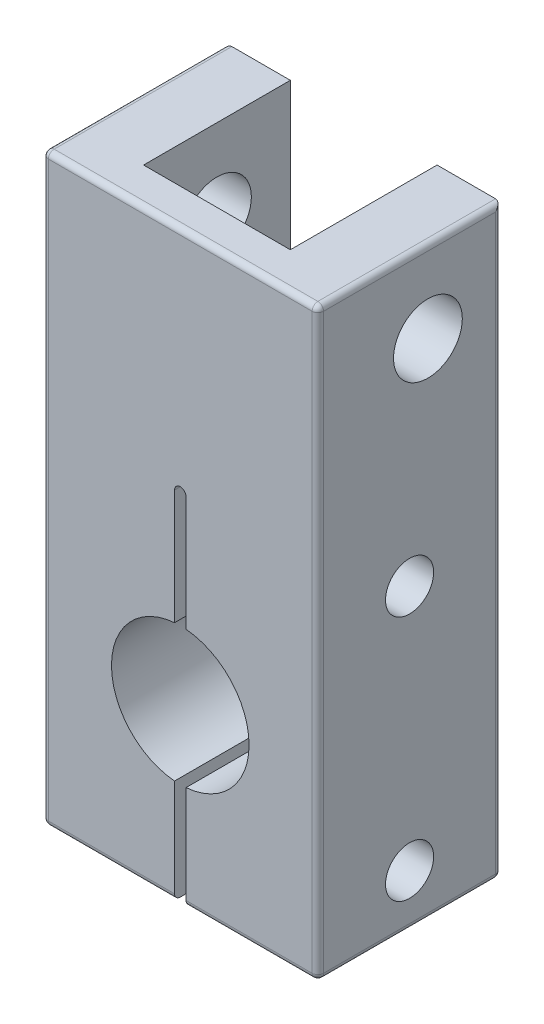
ISO-10303-21;
HEADER;
FILE_DESCRIPTION(('STEP AP214'),'2;1');
FILE_NAME('part.step','',(''),(''),'','','');
FILE_SCHEMA(('AUTOMOTIVE_DESIGN { 1 0 10303 214 1 1 1 1 }'));
ENDSEC;
DATA;
#1=APPLICATION_CONTEXT('core data for automotive mechanical design processes');
#2=APPLICATION_PROTOCOL_DEFINITION('international standard','automotive_design',2000,#1);
#3=PRODUCT_CONTEXT('',#1,'mechanical');
#4=PRODUCT('Part','Part','',(#3));
#5=PRODUCT_RELATED_PRODUCT_CATEGORY('part','',(#4));
#6=PRODUCT_DEFINITION_FORMATION('','',#4);
#7=PRODUCT_DEFINITION_CONTEXT('part definition',#1,'design');
#8=PRODUCT_DEFINITION('design','',#6,#7);
#9=PRODUCT_DEFINITION_SHAPE('','',#8);
#10=(LENGTH_UNIT() NAMED_UNIT(*) SI_UNIT(.MILLI.,.METRE.));
#11=(NAMED_UNIT(*) PLANE_ANGLE_UNIT() SI_UNIT($,.RADIAN.));
#12=(NAMED_UNIT(*) SI_UNIT($,.STERADIAN.) SOLID_ANGLE_UNIT());
#13=UNCERTAINTY_MEASURE_WITH_UNIT(LENGTH_MEASURE(1.E-05),#10,'distance_accuracy_value','');
#14=(GEOMETRIC_REPRESENTATION_CONTEXT(3) GLOBAL_UNCERTAINTY_ASSIGNED_CONTEXT((#13)) GLOBAL_UNIT_ASSIGNED_CONTEXT((#10,
#11,#12)) REPRESENTATION_CONTEXT('',''));
#15=CARTESIAN_POINT('',(0.,0.,0.));
#16=DIRECTION('',(0.,0.,1.));
#17=DIRECTION('',(1.,0.,0.));
#18=AXIS2_PLACEMENT_3D('',#15,#16,#17);
#19=CARTESIAN_POINT('',(0.,0.,16.));
#20=DIRECTION('',(0.,1.,0.));
#21=DIRECTION('',(0.,0.,1.));
#22=AXIS2_PLACEMENT_3D('',#19,#20,#21);
#23=PLANE('',#22);
#24=DIRECTION('',(0.,0.,-1.));
#25=VECTOR('',#24,1.);
#26=CARTESIAN_POINT('',(0.499999999999999,0.,16.));
#27=LINE('',#26,#25);
#28=CARTESIAN_POINT('',(0.499999999999999,0.,15.5));
#29=VERTEX_POINT('',#28);
#30=CARTESIAN_POINT('',(0.499999999999999,0.,0.5));
#31=VERTEX_POINT('',#30);
#32=EDGE_CURVE('E370',#29,#31,#27,.T.);
#33=ORIENTED_EDGE('',*,*,#32,.T.);
#34=DIRECTION('',(1.,0.,0.));
#35=VECTOR('',#34,1.);
#36=CARTESIAN_POINT('',(0.,0.,0.5));
#37=LINE('',#36,#35);
#38=CARTESIAN_POINT('',(11.5,0.,0.5));
#39=VERTEX_POINT('',#38);
#40=EDGE_CURVE('E372',#31,#39,#37,.T.);
#41=ORIENTED_EDGE('',*,*,#40,.T.);
#42=DIRECTION('',(0.,0.,-1.));
#43=VECTOR('',#42,1.);
#44=CARTESIAN_POINT('',(11.5,0.,16.001));
#45=LINE('',#44,#43);
#46=CARTESIAN_POINT('',(11.5,0.,15.5));
#47=VERTEX_POINT('',#46);
#48=EDGE_CURVE('E266',#47,#39,#45,.T.);
#49=ORIENTED_EDGE('',*,*,#48,.F.);
#50=DIRECTION('',(1.,0.,0.));
#51=VECTOR('',#50,1.);
#52=CARTESIAN_POINT('',(0.,0.,15.5));
#53=LINE('',#52,#51);
#54=EDGE_CURVE('E368',#47,#29,#53,.F.);
#55=ORIENTED_EDGE('',*,*,#54,.T.);
#56=EDGE_LOOP('',(#33,#41,#49,#55));
#57=FACE_BOUND('',#56,.T.);
#58=ADVANCED_FACE('F33',(#57),#23,.F.);
#59=CARTESIAN_POINT('',(12.,15.,16.));
#60=DIRECTION('',(0.,0.,-1.));
#61=DIRECTION('',(-1.,0.,0.));
#62=AXIS2_PLACEMENT_3D('',#59,#60,#61);
#63=CYLINDRICAL_SURFACE('',#62,6.);
#64=DIRECTION('',(0.,0.,-1.));
#65=VECTOR('',#64,1.);
#66=CARTESIAN_POINT('',(11.5,9.0208696284493,16.));
#67=LINE('',#66,#65);
#68=CARTESIAN_POINT('',(11.5,9.0208696284493,16.));
#69=VERTEX_POINT('',#68);
#70=CARTESIAN_POINT('',(11.5,9.0208696284493,0.));
#71=VERTEX_POINT('',#70);
#72=EDGE_CURVE('E274',#69,#71,#67,.T.);
#73=ORIENTED_EDGE('',*,*,#72,.T.);
#74=CARTESIAN_POINT('',(12.,15.,0.));
#75=DIRECTION('',(0.,0.,1.));
#76=DIRECTION('',(1.,0.,0.));
#77=AXIS2_PLACEMENT_3D('',#74,#75,#76);
#78=CIRCLE('',#77,6.);
#79=CARTESIAN_POINT('',(11.5,20.9791303715507,0.));
#80=VERTEX_POINT('',#79);
#81=EDGE_CURVE('E321',#80,#71,#78,.T.);
#82=ORIENTED_EDGE('',*,*,#81,.F.);
#83=DIRECTION('',(0.,0.,-1.));
#84=VECTOR('',#83,1.);
#85=CARTESIAN_POINT('',(11.5,20.9791303715507,16.));
#86=LINE('',#85,#84);
#87=CARTESIAN_POINT('',(11.5,20.9791303715507,16.));
#88=VERTEX_POINT('',#87);
#89=EDGE_CURVE('E290',#80,#88,#86,.F.);
#90=ORIENTED_EDGE('',*,*,#89,.T.);
#91=CARTESIAN_POINT('',(12.,15.,16.));
#92=DIRECTION('',(0.,0.,1.));
#93=DIRECTION('',(1.,0.,0.));
#94=AXIS2_PLACEMENT_3D('',#91,#92,#93);
#95=CIRCLE('',#94,6.);
#96=EDGE_CURVE('E316',#88,#69,#95,.T.);
#97=ORIENTED_EDGE('',*,*,#96,.T.);
#98=EDGE_LOOP('',(#73,#82,#90,#97));
#99=FACE_BOUND('',#98,.T.);
#100=ADVANCED_FACE('F484',(#99),#63,.F.);
#101=CARTESIAN_POINT('',(0.,0.,16.));
#102=DIRECTION('',(0.,0.,1.));
#103=DIRECTION('',(1.,0.,0.));
#104=AXIS2_PLACEMENT_3D('',#101,#102,#103);
#105=PLANE('',#104);
#106=DIRECTION('',(0.,-1.,0.));
#107=VECTOR('',#106,1.);
#108=CARTESIAN_POINT('',(0.499999999999999,0.,16.));
#109=LINE('',#108,#107);
#110=CARTESIAN_POINT('',(0.500000000000001,50.5,16.));
#111=VERTEX_POINT('',#110);
#112=CARTESIAN_POINT('',(0.499999999999999,0.5,16.));
#113=VERTEX_POINT('',#112);
#114=EDGE_CURVE('E382',#111,#113,#109,.T.);
#115=ORIENTED_EDGE('',*,*,#114,.T.);
#116=DIRECTION('',(1.,0.,0.));
#117=VECTOR('',#116,1.);
#118=CARTESIAN_POINT('',(11.5,0.5,16.));
#119=LINE('',#118,#117);
#120=CARTESIAN_POINT('',(11.5,0.5,16.));
#121=VERTEX_POINT('',#120);
#122=EDGE_CURVE('E386',#113,#121,#119,.T.);
#123=ORIENTED_EDGE('',*,*,#122,.T.);
#124=DIRECTION('',(0.,1.,0.));
#125=VECTOR('',#124,1.);
#126=CARTESIAN_POINT('',(11.5,31.,16.));
#127=LINE('',#126,#125);
#128=EDGE_CURVE('E265',#121,#69,#127,.T.);
#129=ORIENTED_EDGE('',*,*,#128,.T.);
#130=ORIENTED_EDGE('',*,*,#96,.F.);
#131=DIRECTION('',(0.,1.,0.));
#132=VECTOR('',#131,1.);
#133=CARTESIAN_POINT('',(11.5,31.,16.));
#134=LINE('',#133,#132);
#135=CARTESIAN_POINT('',(11.5,31.,16.));
#136=VERTEX_POINT('',#135);
#137=EDGE_CURVE('E296',#88,#136,#134,.T.);
#138=ORIENTED_EDGE('',*,*,#137,.T.);
#139=CARTESIAN_POINT('',(12.,31.,16.));
#140=DIRECTION('',(0.,0.,1.));
#141=DIRECTION('',(1.,0.,0.));
#142=AXIS2_PLACEMENT_3D('',#139,#140,#141);
#143=CIRCLE('',#142,0.500000000000002);
#144=CARTESIAN_POINT('',(12.5,31.,16.));
#145=VERTEX_POINT('',#144);
#146=EDGE_CURVE('E293',#136,#145,#143,.F.);
#147=ORIENTED_EDGE('',*,*,#146,.T.);
#148=DIRECTION('',(0.,-1.,0.));
#149=VECTOR('',#148,1.);
#150=CARTESIAN_POINT('',(12.5,31.,16.));
#151=LINE('',#150,#149);
#152=CARTESIAN_POINT('',(12.5,20.9791303715507,16.));
#153=VERTEX_POINT('',#152);
#154=EDGE_CURVE('E311',#145,#153,#151,.T.);
#155=ORIENTED_EDGE('',*,*,#154,.T.);
#156=CARTESIAN_POINT('',(12.5,9.0208696284493,16.));
#157=VERTEX_POINT('',#156);
#158=EDGE_CURVE('E320',#157,#153,#95,.T.);
#159=ORIENTED_EDGE('',*,*,#158,.F.);
#160=DIRECTION('',(0.,-1.,0.));
#161=VECTOR('',#160,1.);
#162=CARTESIAN_POINT('',(12.5,31.,16.));
#163=LINE('',#162,#161);
#164=CARTESIAN_POINT('',(12.5,0.5,16.));
#165=VERTEX_POINT('',#164);
#166=EDGE_CURVE('E280',#157,#165,#163,.T.);
#167=ORIENTED_EDGE('',*,*,#166,.T.);
#168=DIRECTION('',(1.,0.,0.));
#169=VECTOR('',#168,1.);
#170=CARTESIAN_POINT('',(24.,0.5,16.));
#171=LINE('',#170,#169);
#172=CARTESIAN_POINT('',(23.5,0.5,16.));
#173=VERTEX_POINT('',#172);
#174=EDGE_CURVE('E384',#165,#173,#171,.T.);
#175=ORIENTED_EDGE('',*,*,#174,.T.);
#176=DIRECTION('',(0.,1.,0.));
#177=VECTOR('',#176,1.);
#178=CARTESIAN_POINT('',(23.5,51.,16.));
#179=LINE('',#178,#177);
#180=CARTESIAN_POINT('',(23.5,50.5,16.));
#181=VERTEX_POINT('',#180);
#182=EDGE_CURVE('E380',#173,#181,#179,.T.);
#183=ORIENTED_EDGE('',*,*,#182,.T.);
#184=DIRECTION('',(-1.,0.,0.));
#185=VECTOR('',#184,1.);
#186=CARTESIAN_POINT('',(0.,50.5,16.));
#187=LINE('',#186,#185);
#188=EDGE_CURVE('E378',#181,#111,#187,.T.);
#189=ORIENTED_EDGE('',*,*,#188,.T.);
#190=EDGE_LOOP('',(#115,#123,#129,#130,#138,#147,#155,#159,#167,#175,#183,#189));
#191=FACE_BOUND('',#190,.T.);
#192=ADVANCED_FACE('F491',(#191),#105,.T.);
#193=CARTESIAN_POINT('',(0.,0.,0.));
#194=DIRECTION('',(0.,0.,1.));
#195=DIRECTION('',(1.,0.,0.));
#196=AXIS2_PLACEMENT_3D('',#193,#194,#195);
#197=PLANE('',#196);
#198=DIRECTION('',(1.,0.,0.));
#199=VECTOR('',#198,1.);
#200=CARTESIAN_POINT('',(0.,0.5,0.));
#201=LINE('',#200,#199);
#202=CARTESIAN_POINT('',(11.5,0.500000000000007,0.));
#203=VERTEX_POINT('',#202);
#204=CARTESIAN_POINT('',(0.499999999999999,0.5,0.));
#205=VERTEX_POINT('',#204);
#206=EDGE_CURVE('E354',#203,#205,#201,.F.);
#207=ORIENTED_EDGE('',*,*,#206,.T.);
#208=DIRECTION('',(0.,-1.,0.));
#209=VECTOR('',#208,1.);
#210=CARTESIAN_POINT('',(0.499999999999999,0.,0.));
#211=LINE('',#210,#209);
#212=CARTESIAN_POINT('',(0.5,51.,0.));
#213=VERTEX_POINT('',#212);
#214=EDGE_CURVE('E356',#205,#213,#211,.F.);
#215=ORIENTED_EDGE('',*,*,#214,.T.);
#216=DIRECTION('',(-1.,0.,0.));
#217=VECTOR('',#216,1.);
#218=CARTESIAN_POINT('',(24.,51.,0.));
#219=LINE('',#218,#217);
#220=CARTESIAN_POINT('',(5.59999999999999,51.,0.));
#221=VERTEX_POINT('',#220);
#222=EDGE_CURVE('E319',#221,#213,#219,.T.);
#223=ORIENTED_EDGE('',*,*,#222,.F.);
#224=DIRECTION('',(0.,1.,0.));
#225=VECTOR('',#224,1.);
#226=CARTESIAN_POINT('',(5.59999999999999,36.,0.));
#227=LINE('',#226,#225);
#228=CARTESIAN_POINT('',(5.59999999999999,36.,0.));
#229=VERTEX_POINT('',#228);
#230=EDGE_CURVE('E239',#229,#221,#227,.T.);
#231=ORIENTED_EDGE('',*,*,#230,.F.);
#232=DIRECTION('',(-1.,0.,0.));
#233=VECTOR('',#232,1.);
#234=CARTESIAN_POINT('',(5.59999999999999,36.,0.));
#235=LINE('',#234,#233);
#236=CARTESIAN_POINT('',(18.4,36.,0.));
#237=VERTEX_POINT('',#236);
#238=EDGE_CURVE('E213',#237,#229,#235,.T.);
#239=ORIENTED_EDGE('',*,*,#238,.F.);
#240=DIRECTION('',(0.,1.,0.));
#241=VECTOR('',#240,1.);
#242=CARTESIAN_POINT('',(18.4,36.,0.));
#243=LINE('',#242,#241);
#244=CARTESIAN_POINT('',(18.4,51.,0.));
#245=VERTEX_POINT('',#244);
#246=EDGE_CURVE('E242',#237,#245,#243,.T.);
#247=ORIENTED_EDGE('',*,*,#246,.T.);
#248=CARTESIAN_POINT('',(23.5,51.,0.));
#249=VERTEX_POINT('',#248);
#250=EDGE_CURVE('E324',#249,#245,#219,.T.);
#251=ORIENTED_EDGE('',*,*,#250,.F.);
#252=DIRECTION('',(0.,1.,0.));
#253=VECTOR('',#252,1.);
#254=CARTESIAN_POINT('',(23.5,0.,0.));
#255=LINE('',#254,#253);
#256=CARTESIAN_POINT('',(23.5,0.5,0.));
#257=VERTEX_POINT('',#256);
#258=EDGE_CURVE('E350',#249,#257,#255,.F.);
#259=ORIENTED_EDGE('',*,*,#258,.T.);
#260=DIRECTION('',(1.,0.,0.));
#261=VECTOR('',#260,1.);
#262=CARTESIAN_POINT('',(0.,0.5,0.));
#263=LINE('',#262,#261);
#264=CARTESIAN_POINT('',(12.5,0.500000000000007,0.));
#265=VERTEX_POINT('',#264);
#266=EDGE_CURVE('E352',#257,#265,#263,.F.);
#267=ORIENTED_EDGE('',*,*,#266,.T.);
#268=DIRECTION('',(0.,-1.,0.));
#269=VECTOR('',#268,1.);
#270=CARTESIAN_POINT('',(12.5,31.,0.));
#271=LINE('',#270,#269);
#272=CARTESIAN_POINT('',(12.5,9.0208696284493,0.));
#273=VERTEX_POINT('',#272);
#274=EDGE_CURVE('E270',#273,#265,#271,.T.);
#275=ORIENTED_EDGE('',*,*,#274,.F.);
#276=CARTESIAN_POINT('',(12.5,20.9791303715507,0.));
#277=VERTEX_POINT('',#276);
#278=EDGE_CURVE('E315',#273,#277,#78,.T.);
#279=ORIENTED_EDGE('',*,*,#278,.T.);
#280=DIRECTION('',(0.,-1.,0.));
#281=VECTOR('',#280,1.);
#282=CARTESIAN_POINT('',(12.5,31.,0.));
#283=LINE('',#282,#281);
#284=CARTESIAN_POINT('',(12.5,31.,0.));
#285=VERTEX_POINT('',#284);
#286=EDGE_CURVE('E302',#285,#277,#283,.T.);
#287=ORIENTED_EDGE('',*,*,#286,.F.);
#288=CARTESIAN_POINT('',(12.,31.,0.));
#289=DIRECTION('',(0.,0.,-1.));
#290=DIRECTION('',(-1.,0.,0.));
#291=AXIS2_PLACEMENT_3D('',#288,#289,#290);
#292=CIRCLE('',#291,0.500000000000002);
#293=CARTESIAN_POINT('',(11.5,31.,0.));
#294=VERTEX_POINT('',#293);
#295=EDGE_CURVE('E299',#294,#285,#292,.T.);
#296=ORIENTED_EDGE('',*,*,#295,.F.);
#297=DIRECTION('',(0.,1.,0.));
#298=VECTOR('',#297,1.);
#299=CARTESIAN_POINT('',(11.5,31.,0.));
#300=LINE('',#299,#298);
#301=EDGE_CURVE('E305',#80,#294,#300,.T.);
#302=ORIENTED_EDGE('',*,*,#301,.F.);
#303=ORIENTED_EDGE('',*,*,#81,.T.);
#304=DIRECTION('',(0.,1.,0.));
#305=VECTOR('',#304,1.);
#306=CARTESIAN_POINT('',(11.5,31.,0.));
#307=LINE('',#306,#305);
#308=EDGE_CURVE('E283',#203,#71,#307,.T.);
#309=ORIENTED_EDGE('',*,*,#308,.F.);
#310=EDGE_LOOP('',(#207,#215,#223,#231,#239,#247,#251,#259,#267,#275,#279,#287,#296,#302,#303,#309));
#311=FACE_BOUND('',#310,.T.);
#312=ADVANCED_FACE('F499',(#311),#197,.F.);
#313=DIRECTION('',(0.,0.,1.));
#314=VECTOR('',#313,1.);
#315=CARTESIAN_POINT('',(12.5,0.,16.001));
#316=LINE('',#315,#314);
#317=CARTESIAN_POINT('',(12.5,0.,0.5));
#318=VERTEX_POINT('',#317);
#319=CARTESIAN_POINT('',(12.5,0.,15.5));
#320=VERTEX_POINT('',#319);
#321=EDGE_CURVE('E269',#318,#320,#316,.T.);
#322=ORIENTED_EDGE('',*,*,#321,.F.);
#323=DIRECTION('',(1.,0.,0.));
#324=VECTOR('',#323,1.);
#325=CARTESIAN_POINT('',(0.,0.,0.5));
#326=LINE('',#325,#324);
#327=CARTESIAN_POINT('',(23.5,0.,0.5));
#328=VERTEX_POINT('',#327);
#329=EDGE_CURVE('E362',#318,#328,#326,.T.);
#330=ORIENTED_EDGE('',*,*,#329,.T.);
#331=DIRECTION('',(0.,0.,-1.));
#332=VECTOR('',#331,1.);
#333=CARTESIAN_POINT('',(23.5,0.,16.));
#334=LINE('',#333,#332);
#335=CARTESIAN_POINT('',(23.5,0.,15.5));
#336=VERTEX_POINT('',#335);
#337=EDGE_CURVE('E358',#328,#336,#334,.F.);
#338=ORIENTED_EDGE('',*,*,#337,.T.);
#339=DIRECTION('',(1.,0.,0.));
#340=VECTOR('',#339,1.);
#341=CARTESIAN_POINT('',(12.5,0.,15.5));
#342=LINE('',#341,#340);
#343=EDGE_CURVE('E360',#336,#320,#342,.F.);
#344=ORIENTED_EDGE('',*,*,#343,.T.);
#345=EDGE_LOOP('',(#322,#330,#338,#344));
#346=FACE_BOUND('',#345,.T.);
#347=ADVANCED_FACE('F487',(#346),#23,.F.);
#348=CARTESIAN_POINT('',(24.,24.,16.));
#349=DIRECTION('',(-1.,0.,0.));
#350=DIRECTION('',(0.,-1.,0.));
#351=AXIS2_PLACEMENT_3D('',#348,#349,#350);
#352=PLANE('',#351);
#353=DIRECTION('',(0.,1.,0.));
#354=VECTOR('',#353,1.);
#355=CARTESIAN_POINT('',(24.,0.,15.5));
#356=LINE('',#355,#354);
#357=CARTESIAN_POINT('',(24.,50.5,15.5));
#358=VERTEX_POINT('',#357);
#359=CARTESIAN_POINT('',(24.,0.500000000000001,15.5));
#360=VERTEX_POINT('',#359);
#361=EDGE_CURVE('E56',#358,#360,#356,.F.);
#362=ORIENTED_EDGE('',*,*,#361,.T.);
#363=DIRECTION('',(0.,0.,-1.));
#364=VECTOR('',#363,1.);
#365=CARTESIAN_POINT('',(24.,0.5,16.));
#366=LINE('',#365,#364);
#367=CARTESIAN_POINT('',(24.,0.500000000000001,0.5));
#368=VERTEX_POINT('',#367);
#369=EDGE_CURVE('E11',#360,#368,#366,.T.);
#370=ORIENTED_EDGE('',*,*,#369,.T.);
#371=DIRECTION('',(0.,1.,0.));
#372=VECTOR('',#371,1.);
#373=CARTESIAN_POINT('',(24.,24.,0.5));
#374=LINE('',#373,#372);
#375=CARTESIAN_POINT('',(24.,50.5,0.5));
#376=VERTEX_POINT('',#375);
#377=EDGE_CURVE('E42',#368,#376,#374,.T.);
#378=ORIENTED_EDGE('',*,*,#377,.T.);
#379=DIRECTION('',(0.,0.,-1.));
#380=VECTOR('',#379,1.);
#381=CARTESIAN_POINT('',(24.,50.5,16.));
#382=LINE('',#381,#380);
#383=EDGE_CURVE('E388',#376,#358,#382,.F.);
#384=ORIENTED_EDGE('',*,*,#383,.T.);
#385=EDGE_LOOP('',(#362,#370,#378,#384));
#386=FACE_BOUND('',#385,.T.);
#387=CARTESIAN_POINT('',(24.,43.9,6.4));
#388=DIRECTION('',(1.,0.,0.));
#389=DIRECTION('',(0.,0.,-1.));
#390=AXIS2_PLACEMENT_3D('',#387,#388,#389);
#391=CIRCLE('',#390,3.);
#392=CARTESIAN_POINT('',(24.,43.9,3.4));
#393=VERTEX_POINT('',#392);
#394=EDGE_CURVE('E448',#393,#393,#391,.T.);
#395=ORIENTED_EDGE('',*,*,#394,.F.);
#396=EDGE_LOOP('',(#395));
#397=FACE_BOUND('',#396,.T.);
#398=CARTESIAN_POINT('',(24.,4.51043481422466,7.99999999999999));
#399=DIRECTION('',(1.,0.,0.));
#400=DIRECTION('',(0.,0.,-1.));
#401=AXIS2_PLACEMENT_3D('',#398,#399,#400);
#402=CIRCLE('',#401,2.1);
#403=CARTESIAN_POINT('',(24.,4.51043481422466,5.89999999999999));
#404=VERTEX_POINT('',#403);
#405=EDGE_CURVE('E241',#404,#404,#402,.T.);
#406=ORIENTED_EDGE('',*,*,#405,.F.);
#407=EDGE_LOOP('',(#406));
#408=FACE_BOUND('',#407,.T.);
#409=CARTESIAN_POINT('',(24.,25.9895651857753,8.));
#410=DIRECTION('',(1.,0.,0.));
#411=DIRECTION('',(0.,0.,-1.));
#412=AXIS2_PLACEMENT_3D('',#409,#410,#411);
#413=CIRCLE('',#412,2.1);
#414=CARTESIAN_POINT('',(24.,25.9895651857753,5.9));
#415=VERTEX_POINT('',#414);
#416=EDGE_CURVE('E255',#415,#415,#413,.T.);
#417=ORIENTED_EDGE('',*,*,#416,.F.);
#418=EDGE_LOOP('',(#417));
#419=FACE_BOUND('',#418,.T.);
#420=ADVANCED_FACE('F498',(#386,#397,#408,#419),#352,.F.);
#421=CARTESIAN_POINT('',(24.,51.,16.));
#422=DIRECTION('',(0.,-1.,0.));
#423=DIRECTION('',(0.,0.,-1.));
#424=AXIS2_PLACEMENT_3D('',#421,#422,#423);
#425=PLANE('',#424);
#426=ORIENTED_EDGE('',*,*,#222,.T.);
#427=DIRECTION('',(0.,0.,-1.));
#428=VECTOR('',#427,1.);
#429=CARTESIAN_POINT('',(0.5,51.,16.));
#430=LINE('',#429,#428);
#431=CARTESIAN_POINT('',(0.500000000000001,51.,15.5));
#432=VERTEX_POINT('',#431);
#433=EDGE_CURVE('E347',#213,#432,#430,.F.);
#434=ORIENTED_EDGE('',*,*,#433,.T.);
#435=DIRECTION('',(-1.,0.,0.));
#436=VECTOR('',#435,1.);
#437=CARTESIAN_POINT('',(24.,51.,15.5));
#438=LINE('',#437,#436);
#439=CARTESIAN_POINT('',(23.5,51.,15.5));
#440=VERTEX_POINT('',#439);
#441=EDGE_CURVE('E345',#432,#440,#438,.F.);
#442=ORIENTED_EDGE('',*,*,#441,.T.);
#443=DIRECTION('',(0.,0.,-1.));
#444=VECTOR('',#443,1.);
#445=CARTESIAN_POINT('',(23.5,51.,16.));
#446=LINE('',#445,#444);
#447=EDGE_CURVE('E343',#440,#249,#446,.T.);
#448=ORIENTED_EDGE('',*,*,#447,.T.);
#449=ORIENTED_EDGE('',*,*,#250,.T.);
#450=DIRECTION('',(0.,0.,-1.));
#451=VECTOR('',#450,1.);
#452=CARTESIAN_POINT('',(18.4,51.,0.));
#453=LINE('',#452,#451);
#454=CARTESIAN_POINT('',(18.4,51.,12.8));
#455=VERTEX_POINT('',#454);
#456=EDGE_CURVE('E226',#455,#245,#453,.T.);
#457=ORIENTED_EDGE('',*,*,#456,.F.);
#458=DIRECTION('',(1.,0.,0.));
#459=VECTOR('',#458,1.);
#460=CARTESIAN_POINT('',(5.6,51.,12.8));
#461=LINE('',#460,#459);
#462=CARTESIAN_POINT('',(5.6,51.,12.8));
#463=VERTEX_POINT('',#462);
#464=EDGE_CURVE('E229',#463,#455,#461,.T.);
#465=ORIENTED_EDGE('',*,*,#464,.F.);
#466=DIRECTION('',(0.,0.,1.));
#467=VECTOR('',#466,1.);
#468=CARTESIAN_POINT('',(5.59999999999999,51.,0.));
#469=LINE('',#468,#467);
#470=EDGE_CURVE('E208',#221,#463,#469,.T.);
#471=ORIENTED_EDGE('',*,*,#470,.F.);
#472=EDGE_LOOP('',(#426,#434,#442,#448,#449,#457,#465,#471));
#473=FACE_BOUND('',#472,.T.);
#474=ADVANCED_FACE('F505',(#473),#425,.F.);
#475=CARTESIAN_POINT('',(0.,51.,16.));
#476=DIRECTION('',(1.,0.,0.));
#477=DIRECTION('',(0.,1.,0.));
#478=AXIS2_PLACEMENT_3D('',#475,#476,#477);
#479=PLANE('',#478);
#480=DIRECTION('',(0.,-1.,0.));
#481=VECTOR('',#480,1.);
#482=CARTESIAN_POINT('',(0.,51.,15.5));
#483=LINE('',#482,#481);
#484=CARTESIAN_POINT('',(0.,0.5,15.5));
#485=VERTEX_POINT('',#484);
#486=CARTESIAN_POINT('',(0.,50.5,15.5));
#487=VERTEX_POINT('',#486);
#488=EDGE_CURVE('E326',#485,#487,#483,.F.);
#489=ORIENTED_EDGE('',*,*,#488,.T.);
#490=DIRECTION('',(0.,0.,-1.));
#491=VECTOR('',#490,1.);
#492=CARTESIAN_POINT('',(0.,50.5,16.));
#493=LINE('',#492,#491);
#494=CARTESIAN_POINT('',(0.,50.5,0.5));
#495=VERTEX_POINT('',#494);
#496=EDGE_CURVE('E340',#487,#495,#493,.T.);
#497=ORIENTED_EDGE('',*,*,#496,.T.);
#498=DIRECTION('',(0.,-1.,0.));
#499=VECTOR('',#498,1.);
#500=CARTESIAN_POINT('',(0.,51.,0.5));
#501=LINE('',#500,#499);
#502=CARTESIAN_POINT('',(0.,0.5,0.5));
#503=VERTEX_POINT('',#502);
#504=EDGE_CURVE('E338',#495,#503,#501,.T.);
#505=ORIENTED_EDGE('',*,*,#504,.T.);
#506=DIRECTION('',(0.,0.,-1.));
#507=VECTOR('',#506,1.);
#508=CARTESIAN_POINT('',(0.,0.5,16.));
#509=LINE('',#508,#507);
#510=EDGE_CURVE('E336',#503,#485,#509,.F.);
#511=ORIENTED_EDGE('',*,*,#510,.T.);
#512=EDGE_LOOP('',(#489,#497,#505,#511));
#513=FACE_BOUND('',#512,.T.);
#514=CARTESIAN_POINT('',(0.,43.9,6.4));
#515=DIRECTION('',(1.,0.,0.));
#516=DIRECTION('',(0.,0.,-1.));
#517=AXIS2_PLACEMENT_3D('',#514,#515,#516);
#518=CIRCLE('',#517,3.);
#519=CARTESIAN_POINT('',(0.,43.9,3.4));
#520=VERTEX_POINT('',#519);
#521=EDGE_CURVE('E334',#520,#520,#518,.T.);
#522=ORIENTED_EDGE('',*,*,#521,.T.);
#523=EDGE_LOOP('',(#522));
#524=FACE_BOUND('',#523,.T.);
#525=CARTESIAN_POINT('',(0.,4.51043481422466,7.99999999999999));
#526=DIRECTION('',(1.,0.,0.));
#527=DIRECTION('',(0.,0.,-1.));
#528=AXIS2_PLACEMENT_3D('',#525,#526,#527);
#529=CIRCLE('',#528,2.1);
#530=CARTESIAN_POINT('',(0.,4.51043481422466,5.89999999999999));
#531=VERTEX_POINT('',#530);
#532=EDGE_CURVE('E246',#531,#531,#529,.T.);
#533=ORIENTED_EDGE('',*,*,#532,.T.);
#534=EDGE_LOOP('',(#533));
#535=FACE_BOUND('',#534,.T.);
#536=CARTESIAN_POINT('',(0.,25.9895651857753,8.));
#537=DIRECTION('',(1.,0.,0.));
#538=DIRECTION('',(0.,0.,-1.));
#539=AXIS2_PLACEMENT_3D('',#536,#537,#538);
#540=CIRCLE('',#539,2.1);
#541=CARTESIAN_POINT('',(0.,25.9895651857753,5.9));
#542=VERTEX_POINT('',#541);
#543=EDGE_CURVE('E256',#542,#542,#540,.T.);
#544=ORIENTED_EDGE('',*,*,#543,.T.);
#545=EDGE_LOOP('',(#544));
#546=FACE_BOUND('',#545,.T.);
#547=ADVANCED_FACE('F458',(#513,#524,#535,#546),#479,.F.);
#548=DIRECTION('',(0.,0.,-1.));
#549=VECTOR('',#548,1.);
#550=CARTESIAN_POINT('',(12.5,9.0208696284493,16.));
#551=LINE('',#550,#549);
#552=EDGE_CURVE('E277',#273,#157,#551,.F.);
#553=ORIENTED_EDGE('',*,*,#552,.T.);
#554=ORIENTED_EDGE('',*,*,#158,.T.);
#555=DIRECTION('',(0.,0.,-1.));
#556=VECTOR('',#555,1.);
#557=CARTESIAN_POINT('',(12.5,20.9791303715507,16.));
#558=LINE('',#557,#556);
#559=EDGE_CURVE('E273',#153,#277,#558,.T.);
#560=ORIENTED_EDGE('',*,*,#559,.T.);
#561=ORIENTED_EDGE('',*,*,#278,.F.);
#562=EDGE_LOOP('',(#553,#554,#560,#561));
#563=FACE_BOUND('',#562,.T.);
#564=ADVANCED_FACE('F494',(#563),#63,.F.);
#565=CARTESIAN_POINT('',(12.5,31.,16.001));
#566=DIRECTION('',(1.,0.,0.));
#567=DIRECTION('',(0.,1.,0.));
#568=AXIS2_PLACEMENT_3D('',#565,#566,#567);
#569=PLANE('',#568);
#570=CARTESIAN_POINT('',(12.5,25.9895651857753,8.));
#571=DIRECTION('',(1.,0.,0.));
#572=DIRECTION('',(0.,1.,0.));
#573=AXIS2_PLACEMENT_3D('',#570,#571,#572);
#574=CIRCLE('',#573,2.1);
#575=CARTESIAN_POINT('',(12.5,28.0895651857753,8.));
#576=VERTEX_POINT('',#575);
#577=EDGE_CURVE('E262',#576,#576,#574,.T.);
#578=ORIENTED_EDGE('',*,*,#577,.T.);
#579=EDGE_LOOP('',(#578));
#580=FACE_BOUND('',#579,.T.);
#581=DIRECTION('',(0.,0.,-1.));
#582=VECTOR('',#581,1.);
#583=CARTESIAN_POINT('',(12.5,31.,16.001));
#584=LINE('',#583,#582);
#585=EDGE_CURVE('E308',#145,#285,#584,.T.);
#586=ORIENTED_EDGE('',*,*,#585,.T.);
#587=ORIENTED_EDGE('',*,*,#286,.T.);
#588=ORIENTED_EDGE('',*,*,#559,.F.);
#589=ORIENTED_EDGE('',*,*,#154,.F.);
#590=EDGE_LOOP('',(#586,#587,#588,#589));
#591=FACE_BOUND('',#590,.T.);
#592=ADVANCED_FACE('F531',(#580,#591),#569,.F.);
#593=CARTESIAN_POINT('',(11.5,31.,16.001));
#594=DIRECTION('',(-1.,0.,0.));
#595=DIRECTION('',(0.,-1.,0.));
#596=AXIS2_PLACEMENT_3D('',#593,#594,#595);
#597=PLANE('',#596);
#598=CARTESIAN_POINT('',(11.5,25.9895651857753,8.));
#599=DIRECTION('',(-1.,0.,0.));
#600=DIRECTION('',(0.,-1.,0.));
#601=AXIS2_PLACEMENT_3D('',#598,#599,#600);
#602=CIRCLE('',#601,2.1);
#603=CARTESIAN_POINT('',(11.5,23.8895651857753,8.));
#604=VERTEX_POINT('',#603);
#605=EDGE_CURVE('E259',#604,#604,#602,.T.);
#606=ORIENTED_EDGE('',*,*,#605,.T.);
#607=EDGE_LOOP('',(#606));
#608=FACE_BOUND('',#607,.T.);
#609=ORIENTED_EDGE('',*,*,#89,.F.);
#610=ORIENTED_EDGE('',*,*,#301,.T.);
#611=DIRECTION('',(0.,0.,-1.));
#612=VECTOR('',#611,1.);
#613=CARTESIAN_POINT('',(11.5,31.,16.001));
#614=LINE('',#613,#612);
#615=EDGE_CURVE('E309',#136,#294,#614,.T.);
#616=ORIENTED_EDGE('',*,*,#615,.F.);
#617=ORIENTED_EDGE('',*,*,#137,.F.);
#618=EDGE_LOOP('',(#609,#610,#616,#617));
#619=FACE_BOUND('',#618,.T.);
#620=ADVANCED_FACE('F659',(#608,#619),#597,.F.);
#621=CARTESIAN_POINT('',(12.,31.,16.001));
#622=DIRECTION('',(0.,0.,-1.));
#623=DIRECTION('',(-1.,0.,0.));
#624=AXIS2_PLACEMENT_3D('',#621,#622,#623);
#625=CYLINDRICAL_SURFACE('',#624,0.500000000000002);
#626=ORIENTED_EDGE('',*,*,#615,.T.);
#627=ORIENTED_EDGE('',*,*,#295,.T.);
#628=ORIENTED_EDGE('',*,*,#585,.F.);
#629=ORIENTED_EDGE('',*,*,#146,.F.);
#630=EDGE_LOOP('',(#626,#627,#628,#629));
#631=FACE_BOUND('',#630,.T.);
#632=ADVANCED_FACE('F649',(#631),#625,.F.);
#633=CARTESIAN_POINT('',(12.5,31.,16.001));
#634=DIRECTION('',(1.,0.,0.));
#635=DIRECTION('',(0.,1.,0.));
#636=AXIS2_PLACEMENT_3D('',#633,#634,#635);
#637=PLANE('',#636);
#638=CARTESIAN_POINT('',(12.5,4.51043481422466,7.99999999999999));
#639=DIRECTION('',(1.,0.,0.));
#640=DIRECTION('',(0.,1.,0.));
#641=AXIS2_PLACEMENT_3D('',#638,#639,#640);
#642=CIRCLE('',#641,2.1);
#643=CARTESIAN_POINT('',(12.5,6.61043481422466,7.99999999999999));
#644=VERTEX_POINT('',#643);
#645=EDGE_CURVE('E252',#644,#644,#642,.T.);
#646=ORIENTED_EDGE('',*,*,#645,.T.);
#647=EDGE_LOOP('',(#646));
#648=FACE_BOUND('',#647,.T.);
#649=ORIENTED_EDGE('',*,*,#274,.T.);
#650=CARTESIAN_POINT('',(12.5,0.5,0.5));
#651=DIRECTION('',(1.,0.,0.));
#652=DIRECTION('',(0.,1.,0.));
#653=AXIS2_PLACEMENT_3D('',#650,#651,#652);
#654=CIRCLE('',#653,0.5);
#655=EDGE_CURVE('E366',#265,#318,#654,.F.);
#656=ORIENTED_EDGE('',*,*,#655,.T.);
#657=ORIENTED_EDGE('',*,*,#321,.T.);
#658=CARTESIAN_POINT('',(12.5,0.5,15.5));
#659=DIRECTION('',(1.,0.,0.));
#660=DIRECTION('',(0.,1.,0.));
#661=AXIS2_PLACEMENT_3D('',#658,#659,#660);
#662=CIRCLE('',#661,0.5);
#663=EDGE_CURVE('E364',#320,#165,#662,.F.);
#664=ORIENTED_EDGE('',*,*,#663,.T.);
#665=ORIENTED_EDGE('',*,*,#166,.F.);
#666=ORIENTED_EDGE('',*,*,#552,.F.);
#667=EDGE_LOOP('',(#649,#656,#657,#664,#665,#666));
#668=FACE_BOUND('',#667,.T.);
#669=ADVANCED_FACE('F524',(#648,#668),#637,.F.);
#670=CARTESIAN_POINT('',(11.5,31.,16.001));
#671=DIRECTION('',(-1.,0.,0.));
#672=DIRECTION('',(0.,-1.,0.));
#673=AXIS2_PLACEMENT_3D('',#670,#671,#672);
#674=PLANE('',#673);
#675=CARTESIAN_POINT('',(11.5,4.51043481422466,7.99999999999999));
#676=DIRECTION('',(-1.,0.,0.));
#677=DIRECTION('',(0.,-1.,0.));
#678=AXIS2_PLACEMENT_3D('',#675,#676,#677);
#679=CIRCLE('',#678,2.1);
#680=CARTESIAN_POINT('',(11.5,2.41043481422465,7.99999999999999));
#681=VERTEX_POINT('',#680);
#682=EDGE_CURVE('E249',#681,#681,#679,.T.);
#683=ORIENTED_EDGE('',*,*,#682,.T.);
#684=EDGE_LOOP('',(#683));
#685=FACE_BOUND('',#684,.T.);
#686=ORIENTED_EDGE('',*,*,#48,.T.);
#687=CARTESIAN_POINT('',(11.5,0.5,0.5));
#688=DIRECTION('',(-1.,0.,0.));
#689=DIRECTION('',(0.,-1.,0.));
#690=AXIS2_PLACEMENT_3D('',#687,#688,#689);
#691=CIRCLE('',#690,0.5);
#692=EDGE_CURVE('E376',#39,#203,#691,.F.);
#693=ORIENTED_EDGE('',*,*,#692,.T.);
#694=ORIENTED_EDGE('',*,*,#308,.T.);
#695=ORIENTED_EDGE('',*,*,#72,.F.);
#696=ORIENTED_EDGE('',*,*,#128,.F.);
#697=CARTESIAN_POINT('',(11.5,0.5,15.5));
#698=DIRECTION('',(-1.,0.,0.));
#699=DIRECTION('',(0.,-1.,0.));
#700=AXIS2_PLACEMENT_3D('',#697,#698,#699);
#701=CIRCLE('',#700,0.5);
#702=EDGE_CURVE('E374',#121,#47,#701,.F.);
#703=ORIENTED_EDGE('',*,*,#702,.T.);
#704=EDGE_LOOP('',(#686,#693,#694,#695,#696,#703));
#705=FACE_BOUND('',#704,.T.);
#706=ADVANCED_FACE('F633',(#685,#705),#674,.F.);
#707=CARTESIAN_POINT('',(0.,25.9895651857753,8.));
#708=DIRECTION('',(1.,0.,0.));
#709=DIRECTION('',(0.,0.,-1.));
#710=AXIS2_PLACEMENT_3D('',#707,#708,#709);
#711=CYLINDRICAL_SURFACE('',#710,2.1);
#712=ORIENTED_EDGE('',*,*,#543,.F.);
#713=EDGE_LOOP('',(#712));
#714=FACE_BOUND('',#713,.T.);
#715=ORIENTED_EDGE('',*,*,#605,.F.);
#716=EDGE_LOOP('',(#715));
#717=FACE_BOUND('',#716,.T.);
#718=ADVANCED_FACE('F624',(#714,#717),#711,.F.);
#719=ORIENTED_EDGE('',*,*,#416,.T.);
#720=EDGE_LOOP('',(#719));
#721=FACE_BOUND('',#720,.T.);
#722=ORIENTED_EDGE('',*,*,#577,.F.);
#723=EDGE_LOOP('',(#722));
#724=FACE_BOUND('',#723,.T.);
#725=ADVANCED_FACE('F616',(#721,#724),#711,.F.);
#726=CARTESIAN_POINT('',(0.,4.51043481422466,7.99999999999999));
#727=DIRECTION('',(1.,0.,0.));
#728=DIRECTION('',(0.,0.,-1.));
#729=AXIS2_PLACEMENT_3D('',#726,#727,#728);
#730=CYLINDRICAL_SURFACE('',#729,2.1);
#731=ORIENTED_EDGE('',*,*,#532,.F.);
#732=EDGE_LOOP('',(#731));
#733=FACE_BOUND('',#732,.T.);
#734=ORIENTED_EDGE('',*,*,#682,.F.);
#735=EDGE_LOOP('',(#734));
#736=FACE_BOUND('',#735,.T.);
#737=ADVANCED_FACE('F479',(#733,#736),#730,.F.);
#738=ORIENTED_EDGE('',*,*,#405,.T.);
#739=EDGE_LOOP('',(#738));
#740=FACE_BOUND('',#739,.T.);
#741=ORIENTED_EDGE('',*,*,#645,.F.);
#742=EDGE_LOOP('',(#741));
#743=FACE_BOUND('',#742,.T.);
#744=ADVANCED_FACE('F471',(#740,#743),#730,.F.);
#745=CARTESIAN_POINT('',(5.59999999999999,36.,0.));
#746=DIRECTION('',(-1.,0.,0.));
#747=DIRECTION('',(0.,0.,1.));
#748=AXIS2_PLACEMENT_3D('',#745,#746,#747);
#749=PLANE('',#748);
#750=CARTESIAN_POINT('',(5.59999999999999,43.9,6.4));
#751=DIRECTION('',(-1.,0.,0.));
#752=DIRECTION('',(0.,0.,1.));
#753=AXIS2_PLACEMENT_3D('',#750,#751,#752);
#754=CIRCLE('',#753,3.);
#755=CARTESIAN_POINT('',(5.6,43.9,9.4));
#756=VERTEX_POINT('',#755);
#757=EDGE_CURVE('E232',#756,#756,#754,.T.);
#758=ORIENTED_EDGE('',*,*,#757,.T.);
#759=EDGE_LOOP('',(#758));
#760=FACE_BOUND('',#759,.T.);
#761=ORIENTED_EDGE('',*,*,#470,.T.);
#762=DIRECTION('',(0.,1.,0.));
#763=VECTOR('',#762,1.);
#764=CARTESIAN_POINT('',(5.6,36.,12.8));
#765=LINE('',#764,#763);
#766=CARTESIAN_POINT('',(5.6,36.,12.8));
#767=VERTEX_POINT('',#766);
#768=EDGE_CURVE('E201',#767,#463,#765,.T.);
#769=ORIENTED_EDGE('',*,*,#768,.F.);
#770=DIRECTION('',(0.,0.,1.));
#771=VECTOR('',#770,1.);
#772=CARTESIAN_POINT('',(5.59999999999999,36.,0.));
#773=LINE('',#772,#771);
#774=EDGE_CURVE('E205',#229,#767,#773,.T.);
#775=ORIENTED_EDGE('',*,*,#774,.F.);
#776=ORIENTED_EDGE('',*,*,#230,.T.);
#777=EDGE_LOOP('',(#761,#769,#775,#776));
#778=FACE_BOUND('',#777,.T.);
#779=ADVANCED_FACE('F203',(#760,#778),#749,.F.);
#780=CARTESIAN_POINT('',(18.4,36.,0.));
#781=DIRECTION('',(1.,0.,0.));
#782=DIRECTION('',(0.,0.,-1.));
#783=AXIS2_PLACEMENT_3D('',#780,#781,#782);
#784=PLANE('',#783);
#785=CARTESIAN_POINT('',(18.4,43.9,6.4));
#786=DIRECTION('',(1.,0.,0.));
#787=DIRECTION('',(0.,0.,-1.));
#788=AXIS2_PLACEMENT_3D('',#785,#786,#787);
#789=CIRCLE('',#788,3.);
#790=CARTESIAN_POINT('',(18.4,43.9,3.4));
#791=VERTEX_POINT('',#790);
#792=EDGE_CURVE('E331',#791,#791,#789,.T.);
#793=ORIENTED_EDGE('',*,*,#792,.T.);
#794=EDGE_LOOP('',(#793));
#795=FACE_BOUND('',#794,.T.);
#796=ORIENTED_EDGE('',*,*,#456,.T.);
#797=ORIENTED_EDGE('',*,*,#246,.F.);
#798=DIRECTION('',(0.,0.,-1.));
#799=VECTOR('',#798,1.);
#800=CARTESIAN_POINT('',(18.4,36.,0.));
#801=LINE('',#800,#799);
#802=CARTESIAN_POINT('',(18.4,36.,12.8));
#803=VERTEX_POINT('',#802);
#804=EDGE_CURVE('E221',#803,#237,#801,.T.);
#805=ORIENTED_EDGE('',*,*,#804,.F.);
#806=DIRECTION('',(0.,1.,0.));
#807=VECTOR('',#806,1.);
#808=CARTESIAN_POINT('',(18.4,36.,12.8));
#809=LINE('',#808,#807);
#810=EDGE_CURVE('E212',#803,#455,#809,.T.);
#811=ORIENTED_EDGE('',*,*,#810,.T.);
#812=EDGE_LOOP('',(#796,#797,#805,#811));
#813=FACE_BOUND('',#812,.T.);
#814=ADVANCED_FACE('F470',(#795,#813),#784,.F.);
#815=CARTESIAN_POINT('',(5.6,36.,12.8));
#816=DIRECTION('',(0.,0.,1.));
#817=DIRECTION('',(1.,0.,0.));
#818=AXIS2_PLACEMENT_3D('',#815,#816,#817);
#819=PLANE('',#818);
#820=ORIENTED_EDGE('',*,*,#464,.T.);
#821=ORIENTED_EDGE('',*,*,#810,.F.);
#822=DIRECTION('',(1.,0.,0.));
#823=VECTOR('',#822,1.);
#824=CARTESIAN_POINT('',(5.6,36.,12.8));
#825=LINE('',#824,#823);
#826=EDGE_CURVE('E216',#767,#803,#825,.T.);
#827=ORIENTED_EDGE('',*,*,#826,.F.);
#828=ORIENTED_EDGE('',*,*,#768,.T.);
#829=EDGE_LOOP('',(#820,#821,#827,#828));
#830=FACE_BOUND('',#829,.T.);
#831=ADVANCED_FACE('F217',(#830),#819,.F.);
#832=CARTESIAN_POINT('',(0.,36.,0.));
#833=DIRECTION('',(0.,1.,0.));
#834=DIRECTION('',(0.,0.,1.));
#835=AXIS2_PLACEMENT_3D('',#832,#833,#834);
#836=PLANE('',#835);
#837=ORIENTED_EDGE('',*,*,#774,.T.);
#838=ORIENTED_EDGE('',*,*,#826,.T.);
#839=ORIENTED_EDGE('',*,*,#804,.T.);
#840=ORIENTED_EDGE('',*,*,#238,.T.);
#841=EDGE_LOOP('',(#837,#838,#839,#840));
#842=FACE_BOUND('',#841,.T.);
#843=ADVANCED_FACE('F223',(#842),#836,.T.);
#844=CARTESIAN_POINT('',(0.,43.9,6.4));
#845=DIRECTION('',(1.,0.,0.));
#846=DIRECTION('',(0.,0.,-1.));
#847=AXIS2_PLACEMENT_3D('',#844,#845,#846);
#848=CYLINDRICAL_SURFACE('',#847,3.);
#849=ORIENTED_EDGE('',*,*,#394,.T.);
#850=EDGE_LOOP('',(#849));
#851=FACE_BOUND('',#850,.T.);
#852=ORIENTED_EDGE('',*,*,#792,.F.);
#853=EDGE_LOOP('',(#852));
#854=FACE_BOUND('',#853,.T.);
#855=ADVANCED_FACE('F464',(#851,#854),#848,.F.);
#856=ORIENTED_EDGE('',*,*,#521,.F.);
#857=EDGE_LOOP('',(#856));
#858=FACE_BOUND('',#857,.T.);
#859=ORIENTED_EDGE('',*,*,#757,.F.);
#860=EDGE_LOOP('',(#859));
#861=FACE_BOUND('',#860,.T.);
#862=ADVANCED_FACE('F461',(#858,#861),#848,.F.);
#863=CARTESIAN_POINT('',(0.,0.5,0.5));
#864=DIRECTION('',(1.,0.,0.));
#865=DIRECTION('',(0.,0.,-1.));
#866=AXIS2_PLACEMENT_3D('',#863,#864,#865);
#867=CYLINDRICAL_SURFACE('',#866,0.5);
#868=CARTESIAN_POINT('',(23.5,0.5,0.5));
#869=DIRECTION('',(1.,0.,0.));
#870=DIRECTION('',(0.,0.,-1.));
#871=AXIS2_PLACEMENT_3D('',#868,#869,#870);
#872=CIRCLE('',#871,0.5);
#873=EDGE_CURVE('E37',#328,#257,#872,.T.);
#874=ORIENTED_EDGE('',*,*,#873,.F.);
#875=ORIENTED_EDGE('',*,*,#329,.F.);
#876=ORIENTED_EDGE('',*,*,#655,.F.);
#877=ORIENTED_EDGE('',*,*,#266,.F.);
#878=EDGE_LOOP('',(#874,#875,#876,#877));
#879=FACE_BOUND('',#878,.T.);
#880=ADVANCED_FACE('F35',(#879),#867,.T.);
#881=CARTESIAN_POINT('',(23.5,0.5,0.5));
#882=DIRECTION('',(0.,0.,1.));
#883=DIRECTION('',(1.,0.,0.));
#884=AXIS2_PLACEMENT_3D('',#881,#882,#883);
#885=SPHERICAL_SURFACE('',#884,0.5);
#886=CARTESIAN_POINT('',(23.5,0.5,0.5));
#887=DIRECTION('',(0.,-1.,0.));
#888=DIRECTION('',(1.,0.,0.));
#889=AXIS2_PLACEMENT_3D('',#886,#887,#888);
#890=CIRCLE('',#889,0.5);
#891=EDGE_CURVE('E441',#368,#257,#890,.F.);
#892=ORIENTED_EDGE('',*,*,#891,.F.);
#893=CARTESIAN_POINT('',(23.5,0.5,0.5));
#894=DIRECTION('',(0.,0.,-1.));
#895=DIRECTION('',(-1.,0.,0.));
#896=AXIS2_PLACEMENT_3D('',#893,#894,#895);
#897=CIRCLE('',#896,0.5);
#898=EDGE_CURVE('E442',#328,#368,#897,.F.);
#899=ORIENTED_EDGE('',*,*,#898,.F.);
#900=ORIENTED_EDGE('',*,*,#873,.T.);
#901=EDGE_LOOP('',(#892,#899,#900));
#902=FACE_BOUND('',#901,.T.);
#903=ADVANCED_FACE('F516',(#902),#885,.T.);
#904=CARTESIAN_POINT('',(23.5,0.5,16.));
#905=DIRECTION('',(0.,0.,-1.));
#906=DIRECTION('',(-1.,0.,0.));
#907=AXIS2_PLACEMENT_3D('',#904,#905,#906);
#908=CYLINDRICAL_SURFACE('',#907,0.5);
#909=ORIENTED_EDGE('',*,*,#898,.T.);
#910=ORIENTED_EDGE('',*,*,#369,.F.);
#911=CARTESIAN_POINT('',(23.5,0.5,15.5));
#912=DIRECTION('',(0.,0.,1.));
#913=DIRECTION('',(1.,0.,0.));
#914=AXIS2_PLACEMENT_3D('',#911,#912,#913);
#915=CIRCLE('',#914,0.5);
#916=EDGE_CURVE('E438',#336,#360,#915,.T.);
#917=ORIENTED_EDGE('',*,*,#916,.F.);
#918=ORIENTED_EDGE('',*,*,#337,.F.);
#919=EDGE_LOOP('',(#909,#910,#917,#918));
#920=FACE_BOUND('',#919,.T.);
#921=ADVANCED_FACE('F518',(#920),#908,.T.);
#922=CARTESIAN_POINT('',(0.,0.5,15.5));
#923=DIRECTION('',(-1.,0.,0.));
#924=DIRECTION('',(0.,0.,1.));
#925=AXIS2_PLACEMENT_3D('',#922,#923,#924);
#926=CYLINDRICAL_SURFACE('',#925,0.5);
#927=ORIENTED_EDGE('',*,*,#663,.F.);
#928=ORIENTED_EDGE('',*,*,#343,.F.);
#929=CARTESIAN_POINT('',(23.5,0.5,15.5));
#930=DIRECTION('',(1.,0.,0.));
#931=DIRECTION('',(0.,0.,-1.));
#932=AXIS2_PLACEMENT_3D('',#929,#930,#931);
#933=CIRCLE('',#932,0.5);
#934=EDGE_CURVE('E435',#173,#336,#933,.T.);
#935=ORIENTED_EDGE('',*,*,#934,.F.);
#936=ORIENTED_EDGE('',*,*,#174,.F.);
#937=EDGE_LOOP('',(#927,#928,#935,#936));
#938=FACE_BOUND('',#937,.T.);
#939=ADVANCED_FACE('F521',(#938),#926,.T.);
#940=CARTESIAN_POINT('',(23.5,24.,0.5));
#941=DIRECTION('',(0.,1.,0.));
#942=DIRECTION('',(-1.,0.,0.));
#943=AXIS2_PLACEMENT_3D('',#940,#941,#942);
#944=CYLINDRICAL_SURFACE('',#943,0.5);
#945=ORIENTED_EDGE('',*,*,#891,.T.);
#946=ORIENTED_EDGE('',*,*,#258,.F.);
#947=CARTESIAN_POINT('',(23.5,50.5,0.5));
#948=DIRECTION('',(0.,-0.707106781186547,-0.707106781186547));
#949=DIRECTION('',(0.,0.707106781186547,-0.707106781186547));
#950=AXIS2_PLACEMENT_3D('',#947,#948,#949);
#951=ELLIPSE('',#950,0.707106781186547,0.5);
#952=EDGE_CURVE('E432',#376,#249,#951,.F.);
#953=ORIENTED_EDGE('',*,*,#952,.F.);
#954=ORIENTED_EDGE('',*,*,#377,.F.);
#955=EDGE_LOOP('',(#945,#946,#953,#954));
#956=FACE_BOUND('',#955,.T.);
#957=ADVANCED_FACE('F539',(#956),#944,.T.);
#958=CARTESIAN_POINT('',(23.5,0.5,15.5));
#959=DIRECTION('',(0.,0.,1.));
#960=DIRECTION('',(1.,0.,0.));
#961=AXIS2_PLACEMENT_3D('',#958,#959,#960);
#962=SPHERICAL_SURFACE('',#961,0.5);
#963=ORIENTED_EDGE('',*,*,#934,.T.);
#964=ORIENTED_EDGE('',*,*,#916,.T.);
#965=CARTESIAN_POINT('',(23.5,0.5,15.5));
#966=DIRECTION('',(0.,-1.,0.));
#967=DIRECTION('',(0.,0.,-1.));
#968=AXIS2_PLACEMENT_3D('',#965,#966,#967);
#969=CIRCLE('',#968,0.5);
#970=EDGE_CURVE('E429',#173,#360,#969,.F.);
#971=ORIENTED_EDGE('',*,*,#970,.F.);
#972=EDGE_LOOP('',(#963,#964,#971));
#973=FACE_BOUND('',#972,.T.);
#974=ADVANCED_FACE('F552',(#973),#962,.T.);
#975=CARTESIAN_POINT('',(23.5,50.5,16.));
#976=DIRECTION('',(0.,0.,-1.));
#977=DIRECTION('',(-1.,0.,0.));
#978=AXIS2_PLACEMENT_3D('',#975,#976,#977);
#979=CYLINDRICAL_SURFACE('',#978,0.5);
#980=ORIENTED_EDGE('',*,*,#952,.T.);
#981=ORIENTED_EDGE('',*,*,#447,.F.);
#982=CARTESIAN_POINT('',(23.5,50.5,15.5));
#983=DIRECTION('',(0.,0.,1.));
#984=DIRECTION('',(1.,0.,0.));
#985=AXIS2_PLACEMENT_3D('',#982,#983,#984);
#986=CIRCLE('',#985,0.5);
#987=EDGE_CURVE('E426',#358,#440,#986,.T.);
#988=ORIENTED_EDGE('',*,*,#987,.F.);
#989=ORIENTED_EDGE('',*,*,#383,.F.);
#990=EDGE_LOOP('',(#980,#981,#988,#989));
#991=FACE_BOUND('',#990,.T.);
#992=ADVANCED_FACE('F543',(#991),#979,.T.);
#993=CARTESIAN_POINT('',(23.5,0.,15.5));
#994=DIRECTION('',(0.,-1.,0.));
#995=DIRECTION('',(1.,0.,0.));
#996=AXIS2_PLACEMENT_3D('',#993,#994,#995);
#997=CYLINDRICAL_SURFACE('',#996,0.5);
#998=ORIENTED_EDGE('',*,*,#970,.T.);
#999=ORIENTED_EDGE('',*,*,#361,.F.);
#1000=CARTESIAN_POINT('',(23.5,50.5,15.5));
#1001=DIRECTION('',(0.,1.,0.));
#1002=DIRECTION('',(0.,0.,1.));
#1003=AXIS2_PLACEMENT_3D('',#1000,#1001,#1002);
#1004=CIRCLE('',#1003,0.5);
#1005=EDGE_CURVE('E423',#181,#358,#1004,.T.);
#1006=ORIENTED_EDGE('',*,*,#1005,.F.);
#1007=ORIENTED_EDGE('',*,*,#182,.F.);
#1008=EDGE_LOOP('',(#998,#999,#1006,#1007));
#1009=FACE_BOUND('',#1008,.T.);
#1010=ADVANCED_FACE('F548',(#1009),#997,.T.);
#1011=CARTESIAN_POINT('',(0.,0.5,15.5));
#1012=DIRECTION('',(-1.,0.,0.));
#1013=DIRECTION('',(0.,0.,1.));
#1014=AXIS2_PLACEMENT_3D('',#1011,#1012,#1013);
#1015=CYLINDRICAL_SURFACE('',#1014,0.5);
#1016=ORIENTED_EDGE('',*,*,#702,.F.);
#1017=ORIENTED_EDGE('',*,*,#122,.F.);
#1018=CARTESIAN_POINT('',(0.499999999999999,0.5,15.5));
#1019=DIRECTION('',(-1.,0.,0.));
#1020=DIRECTION('',(0.,0.,1.));
#1021=AXIS2_PLACEMENT_3D('',#1018,#1019,#1020);
#1022=CIRCLE('',#1021,0.5);
#1023=EDGE_CURVE('E420',#29,#113,#1022,.T.);
#1024=ORIENTED_EDGE('',*,*,#1023,.F.);
#1025=ORIENTED_EDGE('',*,*,#54,.F.);
#1026=EDGE_LOOP('',(#1016,#1017,#1024,#1025));
#1027=FACE_BOUND('',#1026,.T.);
#1028=ADVANCED_FACE('F772',(#1027),#1015,.T.);
#1029=CARTESIAN_POINT('',(23.5,50.5,15.5));
#1030=DIRECTION('',(0.,0.,1.));
#1031=DIRECTION('',(1.,0.,0.));
#1032=AXIS2_PLACEMENT_3D('',#1029,#1030,#1031);
#1033=SPHERICAL_SURFACE('',#1032,0.5);
#1034=ORIENTED_EDGE('',*,*,#1005,.T.);
#1035=ORIENTED_EDGE('',*,*,#987,.T.);
#1036=CARTESIAN_POINT('',(23.5,50.5,15.5));
#1037=DIRECTION('',(1.,0.,0.));
#1038=DIRECTION('',(0.,0.,-1.));
#1039=AXIS2_PLACEMENT_3D('',#1036,#1037,#1038);
#1040=CIRCLE('',#1039,0.5);
#1041=EDGE_CURVE('E414',#181,#440,#1040,.F.);
#1042=ORIENTED_EDGE('',*,*,#1041,.F.);
#1043=EDGE_LOOP('',(#1034,#1035,#1042));
#1044=FACE_BOUND('',#1043,.T.);
#1045=ADVANCED_FACE('F769',(#1044),#1033,.T.);
#1046=CARTESIAN_POINT('',(0.499999999999999,0.5,15.5));
#1047=DIRECTION('',(0.,0.,1.));
#1048=DIRECTION('',(1.,0.,0.));
#1049=AXIS2_PLACEMENT_3D('',#1046,#1047,#1048);
#1050=SPHERICAL_SURFACE('',#1049,0.5);
#1051=CARTESIAN_POINT('',(0.499999999999999,0.5,15.5));
#1052=DIRECTION('',(0.,-1.,0.));
#1053=DIRECTION('',(0.,0.,-1.));
#1054=AXIS2_PLACEMENT_3D('',#1051,#1052,#1053);
#1055=CIRCLE('',#1054,0.5);
#1056=EDGE_CURVE('E411',#485,#113,#1055,.F.);
#1057=ORIENTED_EDGE('',*,*,#1056,.F.);
#1058=CARTESIAN_POINT('',(0.499999999999999,0.5,15.5));
#1059=DIRECTION('',(0.,0.,1.));
#1060=DIRECTION('',(1.,0.,0.));
#1061=AXIS2_PLACEMENT_3D('',#1058,#1059,#1060);
#1062=CIRCLE('',#1061,0.5);
#1063=EDGE_CURVE('E417',#29,#485,#1062,.F.);
#1064=ORIENTED_EDGE('',*,*,#1063,.F.);
#1065=ORIENTED_EDGE('',*,*,#1023,.T.);
#1066=EDGE_LOOP('',(#1057,#1064,#1065));
#1067=FACE_BOUND('',#1066,.T.);
#1068=ADVANCED_FACE('F771',(#1067),#1050,.T.);
#1069=CARTESIAN_POINT('',(0.499999999999999,0.5,16.));
#1070=DIRECTION('',(0.,0.,-1.));
#1071=DIRECTION('',(-1.,0.,0.));
#1072=AXIS2_PLACEMENT_3D('',#1069,#1070,#1071);
#1073=CYLINDRICAL_SURFACE('',#1072,0.5);
#1074=ORIENTED_EDGE('',*,*,#1063,.T.);
#1075=ORIENTED_EDGE('',*,*,#510,.F.);
#1076=CARTESIAN_POINT('',(0.499999999999999,0.5,0.5));
#1077=DIRECTION('',(0.,0.,-1.));
#1078=DIRECTION('',(-1.,0.,0.));
#1079=AXIS2_PLACEMENT_3D('',#1076,#1077,#1078);
#1080=CIRCLE('',#1079,0.5);
#1081=EDGE_CURVE('E408',#31,#503,#1080,.T.);
#1082=ORIENTED_EDGE('',*,*,#1081,.F.);
#1083=ORIENTED_EDGE('',*,*,#32,.F.);
#1084=EDGE_LOOP('',(#1074,#1075,#1082,#1083));
#1085=FACE_BOUND('',#1084,.T.);
#1086=ADVANCED_FACE('F778',(#1085),#1073,.T.);
#1087=CARTESIAN_POINT('',(0.,0.5,0.5));
#1088=DIRECTION('',(1.,0.,0.));
#1089=DIRECTION('',(0.,0.,-1.));
#1090=AXIS2_PLACEMENT_3D('',#1087,#1088,#1089);
#1091=CYLINDRICAL_SURFACE('',#1090,0.5);
#1092=ORIENTED_EDGE('',*,*,#692,.F.);
#1093=ORIENTED_EDGE('',*,*,#40,.F.);
#1094=CARTESIAN_POINT('',(0.499999999999999,0.5,0.5));
#1095=DIRECTION('',(-1.,0.,0.));
#1096=DIRECTION('',(0.,0.,1.));
#1097=AXIS2_PLACEMENT_3D('',#1094,#1095,#1096);
#1098=CIRCLE('',#1097,0.5);
#1099=EDGE_CURVE('E405',#205,#31,#1098,.T.);
#1100=ORIENTED_EDGE('',*,*,#1099,.F.);
#1101=ORIENTED_EDGE('',*,*,#206,.F.);
#1102=EDGE_LOOP('',(#1092,#1093,#1100,#1101));
#1103=FACE_BOUND('',#1102,.T.);
#1104=ADVANCED_FACE('F812',(#1103),#1091,.T.);
#1105=CARTESIAN_POINT('',(0.,50.5,15.5));
#1106=DIRECTION('',(1.,0.,0.));
#1107=DIRECTION('',(0.,0.,-1.));
#1108=AXIS2_PLACEMENT_3D('',#1105,#1106,#1107);
#1109=CYLINDRICAL_SURFACE('',#1108,0.5);
#1110=ORIENTED_EDGE('',*,*,#1041,.T.);
#1111=ORIENTED_EDGE('',*,*,#441,.F.);
#1112=CARTESIAN_POINT('',(0.500000000000001,50.5,15.5));
#1113=DIRECTION('',(-1.,0.,0.));
#1114=DIRECTION('',(0.,0.,1.));
#1115=AXIS2_PLACEMENT_3D('',#1112,#1113,#1114);
#1116=CIRCLE('',#1115,0.5);
#1117=EDGE_CURVE('E402',#111,#432,#1116,.T.);
#1118=ORIENTED_EDGE('',*,*,#1117,.F.);
#1119=ORIENTED_EDGE('',*,*,#188,.F.);
#1120=EDGE_LOOP('',(#1110,#1111,#1118,#1119));
#1121=FACE_BOUND('',#1120,.T.);
#1122=ADVANCED_FACE('F765',(#1121),#1109,.T.);
#1123=CARTESIAN_POINT('',(0.499999999999999,0.,15.5));
#1124=DIRECTION('',(0.,1.,0.));
#1125=DIRECTION('',(-1.,0.,0.));
#1126=AXIS2_PLACEMENT_3D('',#1123,#1124,#1125);
#1127=CYLINDRICAL_SURFACE('',#1126,0.5);
#1128=ORIENTED_EDGE('',*,*,#1056,.T.);
#1129=ORIENTED_EDGE('',*,*,#114,.F.);
#1130=CARTESIAN_POINT('',(0.500000000000001,50.5,15.5));
#1131=DIRECTION('',(0.,1.,0.));
#1132=DIRECTION('',(0.,0.,1.));
#1133=AXIS2_PLACEMENT_3D('',#1130,#1131,#1132);
#1134=CIRCLE('',#1133,0.5);
#1135=EDGE_CURVE('E399',#487,#111,#1134,.T.);
#1136=ORIENTED_EDGE('',*,*,#1135,.F.);
#1137=ORIENTED_EDGE('',*,*,#488,.F.);
#1138=EDGE_LOOP('',(#1128,#1129,#1136,#1137));
#1139=FACE_BOUND('',#1138,.T.);
#1140=ADVANCED_FACE('F758',(#1139),#1127,.T.);
#1141=CARTESIAN_POINT('',(0.499999999999999,0.5,0.5));
#1142=DIRECTION('',(0.,0.,1.));
#1143=DIRECTION('',(1.,0.,0.));
#1144=AXIS2_PLACEMENT_3D('',#1141,#1142,#1143);
#1145=SPHERICAL_SURFACE('',#1144,0.5);
#1146=ORIENTED_EDGE('',*,*,#1099,.T.);
#1147=ORIENTED_EDGE('',*,*,#1081,.T.);
#1148=CARTESIAN_POINT('',(0.499999999999999,0.5,0.5));
#1149=DIRECTION('',(0.,-1.,0.));
#1150=DIRECTION('',(0.,0.,-1.));
#1151=AXIS2_PLACEMENT_3D('',#1148,#1149,#1150);
#1152=CIRCLE('',#1151,0.5);
#1153=EDGE_CURVE('E396',#205,#503,#1152,.F.);
#1154=ORIENTED_EDGE('',*,*,#1153,.F.);
#1155=EDGE_LOOP('',(#1146,#1147,#1154));
#1156=FACE_BOUND('',#1155,.T.);
#1157=ADVANCED_FACE('F838',(#1156),#1145,.T.);
#1158=CARTESIAN_POINT('',(0.500000000000001,50.5,15.5));
#1159=DIRECTION('',(0.,0.,1.));
#1160=DIRECTION('',(1.,0.,0.));
#1161=AXIS2_PLACEMENT_3D('',#1158,#1159,#1160);
#1162=SPHERICAL_SURFACE('',#1161,0.5);
#1163=ORIENTED_EDGE('',*,*,#1135,.T.);
#1164=ORIENTED_EDGE('',*,*,#1117,.T.);
#1165=CARTESIAN_POINT('',(0.500000000000001,50.5,15.5));
#1166=DIRECTION('',(0.,0.,1.));
#1167=DIRECTION('',(1.,0.,0.));
#1168=AXIS2_PLACEMENT_3D('',#1165,#1166,#1167);
#1169=CIRCLE('',#1168,0.5);
#1170=EDGE_CURVE('E394',#487,#432,#1169,.F.);
#1171=ORIENTED_EDGE('',*,*,#1170,.F.);
#1172=EDGE_LOOP('',(#1163,#1164,#1171));
#1173=FACE_BOUND('',#1172,.T.);
#1174=ADVANCED_FACE('F761',(#1173),#1162,.T.);
#1175=CARTESIAN_POINT('',(0.500000000000001,51.,0.5));
#1176=DIRECTION('',(0.,-1.,0.));
#1177=DIRECTION('',(1.,0.,0.));
#1178=AXIS2_PLACEMENT_3D('',#1175,#1176,#1177);
#1179=CYLINDRICAL_SURFACE('',#1178,0.5);
#1180=ORIENTED_EDGE('',*,*,#1153,.T.);
#1181=ORIENTED_EDGE('',*,*,#504,.F.);
#1182=CARTESIAN_POINT('',(0.500000000000001,50.5,0.5));
#1183=DIRECTION('',(0.,-0.707106781186547,-0.707106781186547));
#1184=DIRECTION('',(0.,-0.707106781186547,0.707106781186547));
#1185=AXIS2_PLACEMENT_3D('',#1182,#1183,#1184);
#1186=ELLIPSE('',#1185,0.707106781186547,0.5);
#1187=EDGE_CURVE('E392',#213,#495,#1186,.F.);
#1188=ORIENTED_EDGE('',*,*,#1187,.F.);
#1189=ORIENTED_EDGE('',*,*,#214,.F.);
#1190=EDGE_LOOP('',(#1180,#1181,#1188,#1189));
#1191=FACE_BOUND('',#1190,.T.);
#1192=ADVANCED_FACE('F751',(#1191),#1179,.T.);
#1193=CARTESIAN_POINT('',(0.500000000000001,50.5,16.));
#1194=DIRECTION('',(0.,0.,-1.));
#1195=DIRECTION('',(-1.,0.,0.));
#1196=AXIS2_PLACEMENT_3D('',#1193,#1194,#1195);
#1197=CYLINDRICAL_SURFACE('',#1196,0.5);
#1198=ORIENTED_EDGE('',*,*,#1170,.T.);
#1199=ORIENTED_EDGE('',*,*,#433,.F.);
#1200=ORIENTED_EDGE('',*,*,#1187,.T.);
#1201=ORIENTED_EDGE('',*,*,#496,.F.);
#1202=EDGE_LOOP('',(#1198,#1199,#1200,#1201));
#1203=FACE_BOUND('',#1202,.T.);
#1204=ADVANCED_FACE('F745',(#1203),#1197,.T.);
#1205=CLOSED_SHELL('',(#58,#100,#192,#312,#347,#420,#474,#547,#564,#592,#620,#632,#669,#706,
#718,#725,#737,#744,#779,#814,#831,#843,#855,#862,#880,#903,#921,#939,#957,#974,#992,#1010,
#1028,#1045,#1068,#1086,#1104,#1122,#1140,#1157,#1174,#1192,#1204));
#1206=MANIFOLD_SOLID_BREP('B2',#1205);
#1207=ADVANCED_BREP_SHAPE_REPRESENTATION('',(#18,#1206),#14);
#1208=SHAPE_DEFINITION_REPRESENTATION(#9,#1207);
ENDSEC;
END-ISO-10303-21;
